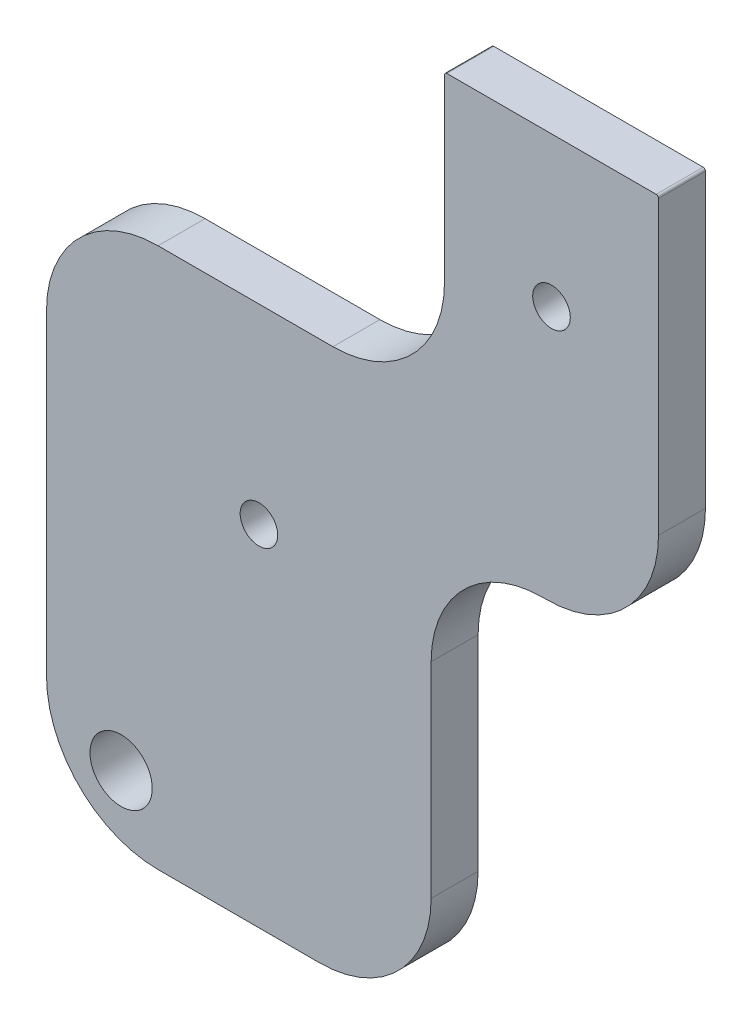
ISO-10303-21;
HEADER;
FILE_DESCRIPTION(('STEP AP214'),'2;1');
FILE_NAME('part.step','',(''),(''),'','','');
FILE_SCHEMA(('AUTOMOTIVE_DESIGN { 1 0 10303 214 1 1 1 1 }'));
ENDSEC;
DATA;
#1=APPLICATION_CONTEXT('core data for automotive mechanical design processes');
#2=APPLICATION_PROTOCOL_DEFINITION('international standard','automotive_design',2000,#1);
#3=PRODUCT_CONTEXT('',#1,'mechanical');
#4=PRODUCT('Part','Part','',(#3));
#5=PRODUCT_RELATED_PRODUCT_CATEGORY('part','',(#4));
#6=PRODUCT_DEFINITION_FORMATION('','',#4);
#7=PRODUCT_DEFINITION_CONTEXT('part definition',#1,'design');
#8=PRODUCT_DEFINITION('design','',#6,#7);
#9=PRODUCT_DEFINITION_SHAPE('','',#8);
#10=(LENGTH_UNIT() NAMED_UNIT(*) SI_UNIT(.MILLI.,.METRE.));
#11=(NAMED_UNIT(*) PLANE_ANGLE_UNIT() SI_UNIT($,.RADIAN.));
#12=(NAMED_UNIT(*) SI_UNIT($,.STERADIAN.) SOLID_ANGLE_UNIT());
#13=UNCERTAINTY_MEASURE_WITH_UNIT(LENGTH_MEASURE(1.E-05),#10,'distance_accuracy_value','');
#14=(GEOMETRIC_REPRESENTATION_CONTEXT(3) GLOBAL_UNCERTAINTY_ASSIGNED_CONTEXT((#13)) GLOBAL_UNIT_ASSIGNED_CONTEXT((#10,
#11,#12)) REPRESENTATION_CONTEXT('',''));
#15=CARTESIAN_POINT('',(0.,0.,0.));
#16=DIRECTION('',(0.,0.,1.));
#17=DIRECTION('',(1.,0.,0.));
#18=AXIS2_PLACEMENT_3D('',#15,#16,#17);
#19=CARTESIAN_POINT('',(73.2620390894138,-348.953453606646,-4.));
#20=DIRECTION('',(-1.,0.,0.));
#21=DIRECTION('',(0.,0.,1.));
#22=AXIS2_PLACEMENT_3D('',#19,#20,#21);
#23=PLANE('',#22);
#24=DIRECTION('',(0.,-1.,0.));
#25=VECTOR('',#24,1.);
#26=CARTESIAN_POINT('',(73.2620390894138,-348.953453606646,-4.));
#27=LINE('',#26,#25);
#28=CARTESIAN_POINT('',(73.2620390894138,-312.453453606646,-4.));
#29=VERTEX_POINT('',#28);
#30=CARTESIAN_POINT('',(73.2620390894138,-339.453453606646,-4.));
#31=VERTEX_POINT('',#30);
#32=EDGE_CURVE('E281',#29,#31,#27,.T.);
#33=ORIENTED_EDGE('',*,*,#32,.T.);
#34=DIRECTION('',(0.,0.,1.));
#35=VECTOR('',#34,1.);
#36=CARTESIAN_POINT('',(73.2620390894138,-339.453453606646,-4.));
#37=LINE('',#36,#35);
#38=CARTESIAN_POINT('',(73.2620390894138,-339.453453606646,0.));
#39=VERTEX_POINT('',#38);
#40=EDGE_CURVE('E182',#31,#39,#37,.T.);
#41=ORIENTED_EDGE('',*,*,#40,.T.);
#42=DIRECTION('',(0.,-1.,0.));
#43=VECTOR('',#42,1.);
#44=CARTESIAN_POINT('',(73.2620390894138,-348.953453606646,0.));
#45=LINE('',#44,#43);
#46=CARTESIAN_POINT('',(73.2620390894138,-312.453453606646,0.));
#47=VERTEX_POINT('',#46);
#48=EDGE_CURVE('E267',#47,#39,#45,.T.);
#49=ORIENTED_EDGE('',*,*,#48,.F.);
#50=DIRECTION('',(0.,0.,1.));
#51=VECTOR('',#50,1.);
#52=CARTESIAN_POINT('',(73.2620390894138,-312.453453606646,-4.));
#53=LINE('',#52,#51);
#54=EDGE_CURVE('E180',#47,#29,#53,.F.);
#55=ORIENTED_EDGE('',*,*,#54,.T.);
#56=EDGE_LOOP('',(#33,#41,#49,#55));
#57=FACE_BOUND('',#56,.T.);
#58=ADVANCED_FACE('F33',(#57),#23,.T.);
#59=CARTESIAN_POINT('',(73.2620390894138,-302.953453606646,-4.));
#60=DIRECTION('',(0.,1.,0.));
#61=DIRECTION('',(0.,0.,1.));
#62=AXIS2_PLACEMENT_3D('',#59,#60,#61);
#63=PLANE('',#62);
#64=DIRECTION('',(-1.,0.,0.));
#65=VECTOR('',#64,1.);
#66=CARTESIAN_POINT('',(73.2620390894138,-302.953453606646,0.));
#67=LINE('',#66,#65);
#68=CARTESIAN_POINT('',(97.6484216423914,-302.953453606646,0.));
#69=VERTEX_POINT('',#68);
#70=CARTESIAN_POINT('',(82.7620390894138,-302.953453606646,0.));
#71=VERTEX_POINT('',#70);
#72=EDGE_CURVE('E154',#69,#71,#67,.T.);
#73=ORIENTED_EDGE('',*,*,#72,.F.);
#74=DIRECTION('',(0.,0.,1.));
#75=VECTOR('',#74,1.);
#76=CARTESIAN_POINT('',(97.6484216423914,-302.953453606646,-4.));
#77=LINE('',#76,#75);
#78=CARTESIAN_POINT('',(97.6484216423914,-302.953453606646,-4.));
#79=VERTEX_POINT('',#78);
#80=EDGE_CURVE('E163',#69,#79,#77,.F.);
#81=ORIENTED_EDGE('',*,*,#80,.T.);
#82=DIRECTION('',(-1.,0.,0.));
#83=VECTOR('',#82,1.);
#84=CARTESIAN_POINT('',(73.2620390894138,-302.953453606646,-4.));
#85=LINE('',#84,#83);
#86=CARTESIAN_POINT('',(82.7620390894138,-302.953453606646,-4.));
#87=VERTEX_POINT('',#86);
#88=EDGE_CURVE('E171',#79,#87,#85,.T.);
#89=ORIENTED_EDGE('',*,*,#88,.T.);
#90=DIRECTION('',(0.,0.,1.));
#91=VECTOR('',#90,1.);
#92=CARTESIAN_POINT('',(82.7620390894138,-302.953453606646,-4.));
#93=LINE('',#92,#91);
#94=EDGE_CURVE('E170',#87,#71,#93,.T.);
#95=ORIENTED_EDGE('',*,*,#94,.T.);
#96=EDGE_LOOP('',(#73,#81,#89,#95));
#97=FACE_BOUND('',#96,.T.);
#98=ADVANCED_FACE('F329',(#97),#63,.T.);
#99=CARTESIAN_POINT('',(107.148421642391,-277.953453606646,-4.));
#100=DIRECTION('',(-1.,0.,0.));
#101=DIRECTION('',(0.,0.,1.));
#102=AXIS2_PLACEMENT_3D('',#99,#100,#101);
#103=PLANE('',#102);
#104=DIRECTION('',(0.,-1.,0.));
#105=VECTOR('',#104,1.);
#106=CARTESIAN_POINT('',(107.148421642391,-277.953453606646,0.));
#107=LINE('',#106,#105);
#108=CARTESIAN_POINT('',(107.148421642391,-278.153453606646,0.));
#109=VERTEX_POINT('',#108);
#110=CARTESIAN_POINT('',(107.148421642391,-293.453453606646,0.));
#111=VERTEX_POINT('',#110);
#112=EDGE_CURVE('E144',#109,#111,#107,.T.);
#113=ORIENTED_EDGE('',*,*,#112,.F.);
#114=DIRECTION('',(0.,0.,1.));
#115=VECTOR('',#114,1.);
#116=CARTESIAN_POINT('',(107.148421642391,-278.153453606646,-4.));
#117=LINE('',#116,#115);
#118=CARTESIAN_POINT('',(107.148421642391,-278.153453606646,-4.));
#119=VERTEX_POINT('',#118);
#120=EDGE_CURVE('E11',#109,#119,#117,.F.);
#121=ORIENTED_EDGE('',*,*,#120,.T.);
#122=DIRECTION('',(0.,-1.,0.));
#123=VECTOR('',#122,1.);
#124=CARTESIAN_POINT('',(107.148421642391,-277.953453606646,-4.));
#125=LINE('',#124,#123);
#126=CARTESIAN_POINT('',(107.148421642391,-293.453453606646,-4.));
#127=VERTEX_POINT('',#126);
#128=EDGE_CURVE('E168',#119,#127,#125,.T.);
#129=ORIENTED_EDGE('',*,*,#128,.T.);
#130=DIRECTION('',(0.,0.,1.));
#131=VECTOR('',#130,1.);
#132=CARTESIAN_POINT('',(107.148421642391,-293.453453606646,0.));
#133=LINE('',#132,#131);
#134=EDGE_CURVE('E162',#127,#111,#133,.T.);
#135=ORIENTED_EDGE('',*,*,#134,.T.);
#136=EDGE_LOOP('',(#113,#121,#129,#135));
#137=FACE_BOUND('',#136,.T.);
#138=ADVANCED_FACE('F167',(#137),#103,.T.);
#139=CARTESIAN_POINT('',(107.148421642391,-277.953453606646,-4.));
#140=DIRECTION('',(0.,1.,0.));
#141=DIRECTION('',(0.,0.,1.));
#142=AXIS2_PLACEMENT_3D('',#139,#140,#141);
#143=PLANE('',#142);
#144=DIRECTION('',(-1.,0.,0.));
#145=VECTOR('',#144,1.);
#146=CARTESIAN_POINT('',(107.148421642391,-277.953453606646,0.));
#147=LINE('',#146,#145);
#148=CARTESIAN_POINT('',(125.168421642391,-277.953453606646,0.));
#149=VERTEX_POINT('',#148);
#150=CARTESIAN_POINT('',(107.348421642391,-277.953453606646,0.));
#151=VERTEX_POINT('',#150);
#152=EDGE_CURVE('E155',#149,#151,#147,.T.);
#153=ORIENTED_EDGE('',*,*,#152,.F.);
#154=DIRECTION('',(0.,0.,1.));
#155=VECTOR('',#154,1.);
#156=CARTESIAN_POINT('',(125.168421642391,-277.953453606646,-4.));
#157=LINE('',#156,#155);
#158=CARTESIAN_POINT('',(125.168421642391,-277.953453606646,-4.));
#159=VERTEX_POINT('',#158);
#160=EDGE_CURVE('E231',#149,#159,#157,.F.);
#161=ORIENTED_EDGE('',*,*,#160,.T.);
#162=DIRECTION('',(-1.,0.,0.));
#163=VECTOR('',#162,1.);
#164=CARTESIAN_POINT('',(107.148421642391,-277.953453606646,-4.));
#165=LINE('',#164,#163);
#166=CARTESIAN_POINT('',(107.348421642391,-277.953453606646,-4.));
#167=VERTEX_POINT('',#166);
#168=EDGE_CURVE('E239',#159,#167,#165,.T.);
#169=ORIENTED_EDGE('',*,*,#168,.T.);
#170=DIRECTION('',(0.,0.,1.));
#171=VECTOR('',#170,1.);
#172=CARTESIAN_POINT('',(107.348421642391,-277.953453606646,-4.));
#173=LINE('',#172,#171);
#174=EDGE_CURVE('E228',#167,#151,#173,.T.);
#175=ORIENTED_EDGE('',*,*,#174,.T.);
#176=EDGE_LOOP('',(#153,#161,#169,#175));
#177=FACE_BOUND('',#176,.T.);
#178=ADVANCED_FACE('F253',(#177),#143,.T.);
#179=CARTESIAN_POINT('',(125.368421642391,-312.503453606646,-4.));
#180=DIRECTION('',(1.,0.,0.));
#181=DIRECTION('',(0.,0.,-1.));
#182=AXIS2_PLACEMENT_3D('',#179,#180,#181);
#183=PLANE('',#182);
#184=DIRECTION('',(0.,1.,0.));
#185=VECTOR('',#184,1.);
#186=CARTESIAN_POINT('',(125.368421642391,-312.503453606646,-4.));
#187=LINE('',#186,#185);
#188=CARTESIAN_POINT('',(125.368421642391,-303.003453606646,-4.));
#189=VERTEX_POINT('',#188);
#190=CARTESIAN_POINT('',(125.368421642391,-278.153453606646,-4.));
#191=VERTEX_POINT('',#190);
#192=EDGE_CURVE('E237',#189,#191,#187,.T.);
#193=ORIENTED_EDGE('',*,*,#192,.T.);
#194=DIRECTION('',(0.,0.,1.));
#195=VECTOR('',#194,1.);
#196=CARTESIAN_POINT('',(125.368421642391,-278.153453606646,-4.));
#197=LINE('',#196,#195);
#198=CARTESIAN_POINT('',(125.368421642391,-278.153453606646,0.));
#199=VERTEX_POINT('',#198);
#200=EDGE_CURVE('E222',#191,#199,#197,.T.);
#201=ORIENTED_EDGE('',*,*,#200,.T.);
#202=DIRECTION('',(0.,1.,0.));
#203=VECTOR('',#202,1.);
#204=CARTESIAN_POINT('',(125.368421642391,-312.503453606646,0.));
#205=LINE('',#204,#203);
#206=CARTESIAN_POINT('',(125.368421642391,-303.003453606646,0.));
#207=VERTEX_POINT('',#206);
#208=EDGE_CURVE('E251',#207,#199,#205,.T.);
#209=ORIENTED_EDGE('',*,*,#208,.F.);
#210=DIRECTION('',(0.,0.,1.));
#211=VECTOR('',#210,1.);
#212=CARTESIAN_POINT('',(125.368421642391,-303.003453606646,-4.));
#213=LINE('',#212,#211);
#214=EDGE_CURVE('E165',#207,#189,#213,.F.);
#215=ORIENTED_EDGE('',*,*,#214,.T.);
#216=EDGE_LOOP('',(#193,#201,#209,#215));
#217=FACE_BOUND('',#216,.T.);
#218=ADVANCED_FACE('F244',(#217),#183,.T.);
#219=CARTESIAN_POINT('',(125.368421642391,-312.503453606646,-4.));
#220=DIRECTION('',(0.,-1.,0.));
#221=DIRECTION('',(0.,0.,-1.));
#222=AXIS2_PLACEMENT_3D('',#219,#220,#221);
#223=PLANE('',#222);
#224=DIRECTION('',(1.,0.,0.));
#225=VECTOR('',#224,1.);
#226=CARTESIAN_POINT('',(125.368421642391,-312.503453606646,0.));
#227=LINE('',#226,#225);
#228=CARTESIAN_POINT('',(115.508421642391,-312.503453606646,0.));
#229=VERTEX_POINT('',#228);
#230=CARTESIAN_POINT('',(115.868421642391,-312.503453606646,0.));
#231=VERTEX_POINT('',#230);
#232=EDGE_CURVE('E256',#229,#231,#227,.T.);
#233=ORIENTED_EDGE('',*,*,#232,.F.);
#234=DIRECTION('',(0.,0.,1.));
#235=VECTOR('',#234,1.);
#236=CARTESIAN_POINT('',(115.508421642391,-312.503453606646,-4.));
#237=LINE('',#236,#235);
#238=CARTESIAN_POINT('',(115.508421642391,-312.503453606646,-4.));
#239=VERTEX_POINT('',#238);
#240=EDGE_CURVE('E214',#229,#239,#237,.F.);
#241=ORIENTED_EDGE('',*,*,#240,.T.);
#242=DIRECTION('',(1.,0.,0.));
#243=VECTOR('',#242,1.);
#244=CARTESIAN_POINT('',(125.368421642391,-312.503453606646,-4.));
#245=LINE('',#244,#243);
#246=CARTESIAN_POINT('',(115.868421642391,-312.503453606646,-4.));
#247=VERTEX_POINT('',#246);
#248=EDGE_CURVE('E247',#239,#247,#245,.T.);
#249=ORIENTED_EDGE('',*,*,#248,.T.);
#250=DIRECTION('',(0.,0.,1.));
#251=VECTOR('',#250,1.);
#252=CARTESIAN_POINT('',(115.868421642391,-312.503453606646,-4.));
#253=LINE('',#252,#251);
#254=EDGE_CURVE('E211',#247,#231,#253,.T.);
#255=ORIENTED_EDGE('',*,*,#254,.T.);
#256=EDGE_LOOP('',(#233,#241,#249,#255));
#257=FACE_BOUND('',#256,.T.);
#258=ADVANCED_FACE('F386',(#257),#223,.T.);
#259=CARTESIAN_POINT('',(106.008421642391,-348.953453606646,-4.));
#260=DIRECTION('',(1.,0.,0.));
#261=DIRECTION('',(0.,0.,-1.));
#262=AXIS2_PLACEMENT_3D('',#259,#260,#261);
#263=PLANE('',#262);
#264=DIRECTION('',(0.,1.,0.));
#265=VECTOR('',#264,1.);
#266=CARTESIAN_POINT('',(106.008421642391,-348.953453606646,-4.));
#267=LINE('',#266,#265);
#268=CARTESIAN_POINT('',(106.008421642391,-339.453453606646,-4.));
#269=VERTEX_POINT('',#268);
#270=CARTESIAN_POINT('',(106.008421642391,-322.003453606646,-4.));
#271=VERTEX_POINT('',#270);
#272=EDGE_CURVE('E275',#269,#271,#267,.T.);
#273=ORIENTED_EDGE('',*,*,#272,.T.);
#274=DIRECTION('',(0.,0.,1.));
#275=VECTOR('',#274,1.);
#276=CARTESIAN_POINT('',(106.008421642391,-322.003453606646,0.));
#277=LINE('',#276,#275);
#278=CARTESIAN_POINT('',(106.008421642391,-322.003453606646,0.));
#279=VERTEX_POINT('',#278);
#280=EDGE_CURVE('E208',#271,#279,#277,.T.);
#281=ORIENTED_EDGE('',*,*,#280,.T.);
#282=DIRECTION('',(0.,1.,0.));
#283=VECTOR('',#282,1.);
#284=CARTESIAN_POINT('',(106.008421642391,-348.953453606646,0.));
#285=LINE('',#284,#283);
#286=CARTESIAN_POINT('',(106.008421642391,-339.453453606646,0.));
#287=VERTEX_POINT('',#286);
#288=EDGE_CURVE('E261',#287,#279,#285,.T.);
#289=ORIENTED_EDGE('',*,*,#288,.F.);
#290=DIRECTION('',(0.,0.,1.));
#291=VECTOR('',#290,1.);
#292=CARTESIAN_POINT('',(106.008421642391,-339.453453606646,-4.));
#293=LINE('',#292,#291);
#294=EDGE_CURVE('E206',#287,#269,#293,.F.);
#295=ORIENTED_EDGE('',*,*,#294,.T.);
#296=EDGE_LOOP('',(#273,#281,#289,#295));
#297=FACE_BOUND('',#296,.T.);
#298=ADVANCED_FACE('F377',(#297),#263,.T.);
#299=CARTESIAN_POINT('',(73.2620390894138,-348.953453606646,-4.));
#300=DIRECTION('',(0.,-1.,0.));
#301=DIRECTION('',(0.,0.,-1.));
#302=AXIS2_PLACEMENT_3D('',#299,#300,#301);
#303=PLANE('',#302);
#304=DIRECTION('',(1.,0.,0.));
#305=VECTOR('',#304,1.);
#306=CARTESIAN_POINT('',(73.2620390894138,-348.953453606646,0.));
#307=LINE('',#306,#305);
#308=CARTESIAN_POINT('',(82.7620390894138,-348.953453606646,0.));
#309=VERTEX_POINT('',#308);
#310=CARTESIAN_POINT('',(96.5084216423913,-348.953453606646,0.));
#311=VERTEX_POINT('',#310);
#312=EDGE_CURVE('E264',#309,#311,#307,.T.);
#313=ORIENTED_EDGE('',*,*,#312,.F.);
#314=DIRECTION('',(0.,0.,1.));
#315=VECTOR('',#314,1.);
#316=CARTESIAN_POINT('',(82.7620390894138,-348.953453606646,-4.));
#317=LINE('',#316,#315);
#318=CARTESIAN_POINT('',(82.7620390894138,-348.953453606646,-4.));
#319=VERTEX_POINT('',#318);
#320=EDGE_CURVE('E196',#309,#319,#317,.F.);
#321=ORIENTED_EDGE('',*,*,#320,.T.);
#322=DIRECTION('',(1.,0.,0.));
#323=VECTOR('',#322,1.);
#324=CARTESIAN_POINT('',(73.2620390894138,-348.953453606646,-4.));
#325=LINE('',#324,#323);
#326=CARTESIAN_POINT('',(96.5084216423913,-348.953453606646,-4.));
#327=VERTEX_POINT('',#326);
#328=EDGE_CURVE('E278',#319,#327,#325,.T.);
#329=ORIENTED_EDGE('',*,*,#328,.T.);
#330=DIRECTION('',(0.,0.,1.));
#331=VECTOR('',#330,1.);
#332=CARTESIAN_POINT('',(96.5084216423913,-348.953453606646,-4.));
#333=LINE('',#332,#331);
#334=EDGE_CURVE('E193',#327,#311,#333,.T.);
#335=ORIENTED_EDGE('',*,*,#334,.T.);
#336=EDGE_LOOP('',(#313,#321,#329,#335));
#337=FACE_BOUND('',#336,.T.);
#338=ADVANCED_FACE('F339',(#337),#303,.T.);
#339=CARTESIAN_POINT('',(0.,0.,-4.));
#340=DIRECTION('',(0.,0.,-1.));
#341=DIRECTION('',(-1.,0.,0.));
#342=AXIS2_PLACEMENT_3D('',#339,#340,#341);
#343=PLANE('',#342);
#344=CARTESIAN_POINT('',(79.6121425415507,-343.223274497217,-4.));
#345=DIRECTION('',(0.,0.,1.));
#346=DIRECTION('',(1.,0.,0.));
#347=AXIS2_PLACEMENT_3D('',#344,#345,#346);
#348=CIRCLE('',#347,2.65);
#349=CARTESIAN_POINT('',(82.2621425415507,-343.223274497217,-4.));
#350=VERTEX_POINT('',#349);
#351=EDGE_CURVE('E295',#350,#350,#348,.T.);
#352=ORIENTED_EDGE('',*,*,#351,.T.);
#353=EDGE_LOOP('',(#352));
#354=FACE_BOUND('',#353,.T.);
#355=CARTESIAN_POINT('',(116.258421642391,-290.703453606646,-4.));
#356=DIRECTION('',(0.,0.,1.));
#357=DIRECTION('',(1.,0.,0.));
#358=AXIS2_PLACEMENT_3D('',#355,#356,#357);
#359=CIRCLE('',#358,1.59999999999999);
#360=CARTESIAN_POINT('',(117.858421642391,-290.703453606646,-4.));
#361=VERTEX_POINT('',#360);
#362=EDGE_CURVE('E289',#361,#361,#359,.T.);
#363=ORIENTED_EDGE('',*,*,#362,.T.);
#364=EDGE_LOOP('',(#363));
#365=FACE_BOUND('',#364,.T.);
#366=CARTESIAN_POINT('',(91.3484216423913,-319.203453606646,-4.));
#367=DIRECTION('',(0.,0.,1.));
#368=DIRECTION('',(1.,0.,0.));
#369=AXIS2_PLACEMENT_3D('',#366,#367,#368);
#370=CIRCLE('',#369,1.59999999999999);
#371=CARTESIAN_POINT('',(92.9484216423913,-319.203453606646,-4.));
#372=VERTEX_POINT('',#371);
#373=EDGE_CURVE('E269',#372,#372,#370,.T.);
#374=ORIENTED_EDGE('',*,*,#373,.T.);
#375=EDGE_LOOP('',(#374));
#376=FACE_BOUND('',#375,.T.);
#377=ORIENTED_EDGE('',*,*,#168,.F.);
#378=CARTESIAN_POINT('',(125.168421642391,-278.153453606646,-4.));
#379=DIRECTION('',(0.,0.,-1.));
#380=DIRECTION('',(-1.,0.,0.));
#381=AXIS2_PLACEMENT_3D('',#378,#379,#380);
#382=CIRCLE('',#381,0.2);
#383=EDGE_CURVE('E41',#159,#191,#382,.T.);
#384=ORIENTED_EDGE('',*,*,#383,.T.);
#385=ORIENTED_EDGE('',*,*,#192,.F.);
#386=CARTESIAN_POINT('',(115.868421642391,-303.003453606646,-4.));
#387=DIRECTION('',(0.,0.,-1.));
#388=DIRECTION('',(-1.,0.,0.));
#389=AXIS2_PLACEMENT_3D('',#386,#387,#388);
#390=CIRCLE('',#389,9.5);
#391=EDGE_CURVE('E202',#189,#247,#390,.T.);
#392=ORIENTED_EDGE('',*,*,#391,.T.);
#393=ORIENTED_EDGE('',*,*,#248,.F.);
#394=CARTESIAN_POINT('',(115.508421642391,-322.003453606646,-4.));
#395=DIRECTION('',(0.,0.,-1.));
#396=DIRECTION('',(-1.,0.,0.));
#397=AXIS2_PLACEMENT_3D('',#394,#395,#396);
#398=CIRCLE('',#397,9.5);
#399=EDGE_CURVE('E220',#239,#271,#398,.F.);
#400=ORIENTED_EDGE('',*,*,#399,.T.);
#401=ORIENTED_EDGE('',*,*,#272,.F.);
#402=CARTESIAN_POINT('',(96.5084216423913,-339.453453606646,-4.));
#403=DIRECTION('',(0.,0.,-1.));
#404=DIRECTION('',(-1.,0.,0.));
#405=AXIS2_PLACEMENT_3D('',#402,#403,#404);
#406=CIRCLE('',#405,9.5);
#407=EDGE_CURVE('E200',#269,#327,#406,.T.);
#408=ORIENTED_EDGE('',*,*,#407,.T.);
#409=ORIENTED_EDGE('',*,*,#328,.F.);
#410=CARTESIAN_POINT('',(82.7620390894138,-339.453453606646,-4.));
#411=DIRECTION('',(0.,0.,-1.));
#412=DIRECTION('',(-1.,0.,0.));
#413=AXIS2_PLACEMENT_3D('',#410,#411,#412);
#414=CIRCLE('',#413,9.5);
#415=EDGE_CURVE('E204',#319,#31,#414,.T.);
#416=ORIENTED_EDGE('',*,*,#415,.T.);
#417=ORIENTED_EDGE('',*,*,#32,.F.);
#418=CARTESIAN_POINT('',(82.7620390894138,-312.453453606646,-4.));
#419=DIRECTION('',(0.,0.,-1.));
#420=DIRECTION('',(-1.,0.,0.));
#421=AXIS2_PLACEMENT_3D('',#418,#419,#420);
#422=CIRCLE('',#421,9.5);
#423=EDGE_CURVE('E198',#29,#87,#422,.T.);
#424=ORIENTED_EDGE('',*,*,#423,.T.);
#425=ORIENTED_EDGE('',*,*,#88,.F.);
#426=CARTESIAN_POINT('',(97.6484216423914,-293.453453606646,-4.));
#427=DIRECTION('',(0.,0.,-1.));
#428=DIRECTION('',(-1.,0.,0.));
#429=AXIS2_PLACEMENT_3D('',#426,#427,#428);
#430=CIRCLE('',#429,9.5);
#431=EDGE_CURVE('E164',#79,#127,#430,.F.);
#432=ORIENTED_EDGE('',*,*,#431,.T.);
#433=ORIENTED_EDGE('',*,*,#128,.F.);
#434=CARTESIAN_POINT('',(107.348421642391,-278.153453606646,-4.));
#435=DIRECTION('',(0.,0.,-1.));
#436=DIRECTION('',(-1.,0.,0.));
#437=AXIS2_PLACEMENT_3D('',#434,#435,#436);
#438=CIRCLE('',#437,0.2);
#439=EDGE_CURVE('E53',#119,#167,#438,.T.);
#440=ORIENTED_EDGE('',*,*,#439,.T.);
#441=EDGE_LOOP('',(#377,#384,#385,#392,#393,#400,#401,#408,#409,#416,#417,#424,#425,#432,#433,#440));
#442=FACE_BOUND('',#441,.T.);
#443=ADVANCED_FACE('F236',(#354,#365,#376,#442),#343,.T.);
#444=CARTESIAN_POINT('',(0.,0.,0.));
#445=DIRECTION('',(0.,0.,-1.));
#446=DIRECTION('',(-1.,0.,0.));
#447=AXIS2_PLACEMENT_3D('',#444,#445,#446);
#448=PLANE('',#447);
#449=CARTESIAN_POINT('',(79.6121425415507,-343.223274497217,0.));
#450=DIRECTION('',(0.,0.,1.));
#451=DIRECTION('',(1.,0.,0.));
#452=AXIS2_PLACEMENT_3D('',#449,#450,#451);
#453=CIRCLE('',#452,2.65);
#454=CARTESIAN_POINT('',(82.2621425415507,-343.223274497217,0.));
#455=VERTEX_POINT('',#454);
#456=EDGE_CURVE('E298',#455,#455,#453,.T.);
#457=ORIENTED_EDGE('',*,*,#456,.F.);
#458=EDGE_LOOP('',(#457));
#459=FACE_BOUND('',#458,.T.);
#460=CARTESIAN_POINT('',(116.258421642391,-290.703453606646,0.));
#461=DIRECTION('',(0.,0.,1.));
#462=DIRECTION('',(1.,0.,0.));
#463=AXIS2_PLACEMENT_3D('',#460,#461,#462);
#464=CIRCLE('',#463,1.59999999999999);
#465=CARTESIAN_POINT('',(117.858421642391,-290.703453606646,0.));
#466=VERTEX_POINT('',#465);
#467=EDGE_CURVE('E292',#466,#466,#464,.T.);
#468=ORIENTED_EDGE('',*,*,#467,.F.);
#469=EDGE_LOOP('',(#468));
#470=FACE_BOUND('',#469,.T.);
#471=CARTESIAN_POINT('',(91.3484216423913,-319.203453606646,0.));
#472=DIRECTION('',(0.,0.,1.));
#473=DIRECTION('',(1.,0.,0.));
#474=AXIS2_PLACEMENT_3D('',#471,#472,#473);
#475=CIRCLE('',#474,1.59999999999999);
#476=CARTESIAN_POINT('',(92.9484216423913,-319.203453606646,0.));
#477=VERTEX_POINT('',#476);
#478=EDGE_CURVE('E286',#477,#477,#475,.T.);
#479=ORIENTED_EDGE('',*,*,#478,.F.);
#480=EDGE_LOOP('',(#479));
#481=FACE_BOUND('',#480,.T.);
#482=ORIENTED_EDGE('',*,*,#208,.T.);
#483=CARTESIAN_POINT('',(125.168421642391,-278.153453606646,0.));
#484=DIRECTION('',(0.,0.,-1.));
#485=DIRECTION('',(-1.,0.,0.));
#486=AXIS2_PLACEMENT_3D('',#483,#484,#485);
#487=CIRCLE('',#486,0.2);
#488=EDGE_CURVE('E226',#199,#149,#487,.F.);
#489=ORIENTED_EDGE('',*,*,#488,.T.);
#490=ORIENTED_EDGE('',*,*,#152,.T.);
#491=CARTESIAN_POINT('',(107.348421642391,-278.153453606646,0.));
#492=DIRECTION('',(0.,0.,-1.));
#493=DIRECTION('',(-1.,0.,0.));
#494=AXIS2_PLACEMENT_3D('',#491,#492,#493);
#495=CIRCLE('',#494,0.2);
#496=EDGE_CURVE('E152',#151,#109,#495,.F.);
#497=ORIENTED_EDGE('',*,*,#496,.T.);
#498=ORIENTED_EDGE('',*,*,#112,.T.);
#499=CARTESIAN_POINT('',(97.6484216423914,-293.453453606646,0.));
#500=DIRECTION('',(0.,0.,-1.));
#501=DIRECTION('',(-1.,0.,0.));
#502=AXIS2_PLACEMENT_3D('',#499,#500,#501);
#503=CIRCLE('',#502,9.5);
#504=EDGE_CURVE('E149',#111,#69,#503,.T.);
#505=ORIENTED_EDGE('',*,*,#504,.T.);
#506=ORIENTED_EDGE('',*,*,#72,.T.);
#507=CARTESIAN_POINT('',(82.7620390894138,-312.453453606646,0.));
#508=DIRECTION('',(0.,0.,-1.));
#509=DIRECTION('',(-1.,0.,0.));
#510=AXIS2_PLACEMENT_3D('',#507,#508,#509);
#511=CIRCLE('',#510,9.5);
#512=EDGE_CURVE('E185',#71,#47,#511,.F.);
#513=ORIENTED_EDGE('',*,*,#512,.T.);
#514=ORIENTED_EDGE('',*,*,#48,.T.);
#515=CARTESIAN_POINT('',(82.7620390894138,-339.453453606646,0.));
#516=DIRECTION('',(0.,0.,-1.));
#517=DIRECTION('',(-1.,0.,0.));
#518=AXIS2_PLACEMENT_3D('',#515,#516,#517);
#519=CIRCLE('',#518,9.5);
#520=EDGE_CURVE('E191',#39,#309,#519,.F.);
#521=ORIENTED_EDGE('',*,*,#520,.T.);
#522=ORIENTED_EDGE('',*,*,#312,.T.);
#523=CARTESIAN_POINT('',(96.5084216423913,-339.453453606646,0.));
#524=DIRECTION('',(0.,0.,-1.));
#525=DIRECTION('',(-1.,0.,0.));
#526=AXIS2_PLACEMENT_3D('',#523,#524,#525);
#527=CIRCLE('',#526,9.5);
#528=EDGE_CURVE('E187',#311,#287,#527,.F.);
#529=ORIENTED_EDGE('',*,*,#528,.T.);
#530=ORIENTED_EDGE('',*,*,#288,.T.);
#531=CARTESIAN_POINT('',(115.508421642391,-322.003453606646,0.));
#532=DIRECTION('',(0.,0.,-1.));
#533=DIRECTION('',(-1.,0.,0.));
#534=AXIS2_PLACEMENT_3D('',#531,#532,#533);
#535=CIRCLE('',#534,9.5);
#536=EDGE_CURVE('E218',#279,#229,#535,.T.);
#537=ORIENTED_EDGE('',*,*,#536,.T.);
#538=ORIENTED_EDGE('',*,*,#232,.T.);
#539=CARTESIAN_POINT('',(115.868421642391,-303.003453606646,0.));
#540=DIRECTION('',(0.,0.,-1.));
#541=DIRECTION('',(-1.,0.,0.));
#542=AXIS2_PLACEMENT_3D('',#539,#540,#541);
#543=CIRCLE('',#542,9.5);
#544=EDGE_CURVE('E189',#231,#207,#543,.F.);
#545=ORIENTED_EDGE('',*,*,#544,.T.);
#546=EDGE_LOOP('',(#482,#489,#490,#497,#498,#505,#506,#513,#514,#521,#522,#529,#530,#537,#538,#545));
#547=FACE_BOUND('',#546,.T.);
#548=ADVANCED_FACE('F147',(#459,#470,#481,#547),#448,.F.);
#549=CARTESIAN_POINT('',(97.6484216423914,-293.453453606646,-4.));
#550=DIRECTION('',(0.,0.,-1.));
#551=DIRECTION('',(-1.,0.,0.));
#552=AXIS2_PLACEMENT_3D('',#549,#550,#551);
#553=CYLINDRICAL_SURFACE('',#552,9.5);
#554=ORIENTED_EDGE('',*,*,#431,.F.);
#555=ORIENTED_EDGE('',*,*,#80,.F.);
#556=ORIENTED_EDGE('',*,*,#504,.F.);
#557=ORIENTED_EDGE('',*,*,#134,.F.);
#558=EDGE_LOOP('',(#554,#555,#556,#557));
#559=FACE_BOUND('',#558,.T.);
#560=ADVANCED_FACE('F161',(#559),#553,.F.);
#561=CARTESIAN_POINT('',(82.7620390894138,-339.453453606646,-4.));
#562=DIRECTION('',(0.,0.,1.));
#563=DIRECTION('',(1.,0.,0.));
#564=AXIS2_PLACEMENT_3D('',#561,#562,#563);
#565=CYLINDRICAL_SURFACE('',#564,9.5);
#566=ORIENTED_EDGE('',*,*,#415,.F.);
#567=ORIENTED_EDGE('',*,*,#320,.F.);
#568=ORIENTED_EDGE('',*,*,#520,.F.);
#569=ORIENTED_EDGE('',*,*,#40,.F.);
#570=EDGE_LOOP('',(#566,#567,#568,#569));
#571=FACE_BOUND('',#570,.T.);
#572=ADVANCED_FACE('F343',(#571),#565,.T.);
#573=CARTESIAN_POINT('',(115.508421642391,-322.003453606646,-4.));
#574=DIRECTION('',(0.,0.,-1.));
#575=DIRECTION('',(-1.,0.,0.));
#576=AXIS2_PLACEMENT_3D('',#573,#574,#575);
#577=CYLINDRICAL_SURFACE('',#576,9.5);
#578=ORIENTED_EDGE('',*,*,#399,.F.);
#579=ORIENTED_EDGE('',*,*,#240,.F.);
#580=ORIENTED_EDGE('',*,*,#536,.F.);
#581=ORIENTED_EDGE('',*,*,#280,.F.);
#582=EDGE_LOOP('',(#578,#579,#580,#581));
#583=FACE_BOUND('',#582,.T.);
#584=ADVANCED_FACE('F346',(#583),#577,.F.);
#585=CARTESIAN_POINT('',(115.868421642391,-303.003453606646,-4.));
#586=DIRECTION('',(0.,0.,1.));
#587=DIRECTION('',(1.,0.,0.));
#588=AXIS2_PLACEMENT_3D('',#585,#586,#587);
#589=CYLINDRICAL_SURFACE('',#588,9.5);
#590=ORIENTED_EDGE('',*,*,#391,.F.);
#591=ORIENTED_EDGE('',*,*,#214,.F.);
#592=ORIENTED_EDGE('',*,*,#544,.F.);
#593=ORIENTED_EDGE('',*,*,#254,.F.);
#594=EDGE_LOOP('',(#590,#591,#592,#593));
#595=FACE_BOUND('',#594,.T.);
#596=ADVANCED_FACE('F350',(#595),#589,.T.);
#597=CARTESIAN_POINT('',(96.5084216423913,-339.453453606646,-4.));
#598=DIRECTION('',(0.,0.,1.));
#599=DIRECTION('',(1.,0.,0.));
#600=AXIS2_PLACEMENT_3D('',#597,#598,#599);
#601=CYLINDRICAL_SURFACE('',#600,9.5);
#602=ORIENTED_EDGE('',*,*,#407,.F.);
#603=ORIENTED_EDGE('',*,*,#294,.F.);
#604=ORIENTED_EDGE('',*,*,#528,.F.);
#605=ORIENTED_EDGE('',*,*,#334,.F.);
#606=EDGE_LOOP('',(#602,#603,#604,#605));
#607=FACE_BOUND('',#606,.T.);
#608=ADVANCED_FACE('F323',(#607),#601,.T.);
#609=CARTESIAN_POINT('',(82.7620390894138,-312.453453606646,-4.));
#610=DIRECTION('',(0.,0.,1.));
#611=DIRECTION('',(1.,0.,0.));
#612=AXIS2_PLACEMENT_3D('',#609,#610,#611);
#613=CYLINDRICAL_SURFACE('',#612,9.5);
#614=ORIENTED_EDGE('',*,*,#423,.F.);
#615=ORIENTED_EDGE('',*,*,#54,.F.);
#616=ORIENTED_EDGE('',*,*,#512,.F.);
#617=ORIENTED_EDGE('',*,*,#94,.F.);
#618=EDGE_LOOP('',(#614,#615,#616,#617));
#619=FACE_BOUND('',#618,.T.);
#620=ADVANCED_FACE('F314',(#619),#613,.T.);
#621=CARTESIAN_POINT('',(91.3484216423913,-319.203453606646,0.));
#622=DIRECTION('',(0.,0.,1.));
#623=DIRECTION('',(1.,0.,0.));
#624=AXIS2_PLACEMENT_3D('',#621,#622,#623);
#625=CYLINDRICAL_SURFACE('',#624,1.59999999999999);
#626=ORIENTED_EDGE('',*,*,#373,.F.);
#627=EDGE_LOOP('',(#626));
#628=FACE_BOUND('',#627,.T.);
#629=ORIENTED_EDGE('',*,*,#478,.T.);
#630=EDGE_LOOP('',(#629));
#631=FACE_BOUND('',#630,.T.);
#632=ADVANCED_FACE('F311',(#628,#631),#625,.F.);
#633=CARTESIAN_POINT('',(116.258421642391,-290.703453606646,0.));
#634=DIRECTION('',(0.,0.,1.));
#635=DIRECTION('',(1.,0.,0.));
#636=AXIS2_PLACEMENT_3D('',#633,#634,#635);
#637=CYLINDRICAL_SURFACE('',#636,1.59999999999999);
#638=ORIENTED_EDGE('',*,*,#362,.F.);
#639=EDGE_LOOP('',(#638));
#640=FACE_BOUND('',#639,.T.);
#641=ORIENTED_EDGE('',*,*,#467,.T.);
#642=EDGE_LOOP('',(#641));
#643=FACE_BOUND('',#642,.T.);
#644=ADVANCED_FACE('F313',(#640,#643),#637,.F.);
#645=CARTESIAN_POINT('',(79.6121425415507,-343.223274497217,0.));
#646=DIRECTION('',(0.,0.,1.));
#647=DIRECTION('',(1.,0.,0.));
#648=AXIS2_PLACEMENT_3D('',#645,#646,#647);
#649=CYLINDRICAL_SURFACE('',#648,2.65);
#650=ORIENTED_EDGE('',*,*,#351,.F.);
#651=EDGE_LOOP('',(#650));
#652=FACE_BOUND('',#651,.T.);
#653=ORIENTED_EDGE('',*,*,#456,.T.);
#654=EDGE_LOOP('',(#653));
#655=FACE_BOUND('',#654,.T.);
#656=ADVANCED_FACE('F302',(#652,#655),#649,.F.);
#657=CARTESIAN_POINT('',(125.168421642391,-278.153453606646,-4.));
#658=DIRECTION('',(0.,0.,1.));
#659=DIRECTION('',(1.,0.,0.));
#660=AXIS2_PLACEMENT_3D('',#657,#658,#659);
#661=CYLINDRICAL_SURFACE('',#660,0.2);
#662=ORIENTED_EDGE('',*,*,#383,.F.);
#663=ORIENTED_EDGE('',*,*,#160,.F.);
#664=ORIENTED_EDGE('',*,*,#488,.F.);
#665=ORIENTED_EDGE('',*,*,#200,.F.);
#666=EDGE_LOOP('',(#662,#663,#664,#665));
#667=FACE_BOUND('',#666,.T.);
#668=ADVANCED_FACE('F249',(#667),#661,.T.);
#669=CARTESIAN_POINT('',(107.348421642391,-278.153453606646,-4.));
#670=DIRECTION('',(0.,0.,1.));
#671=DIRECTION('',(1.,0.,0.));
#672=AXIS2_PLACEMENT_3D('',#669,#670,#671);
#673=CYLINDRICAL_SURFACE('',#672,0.2);
#674=ORIENTED_EDGE('',*,*,#439,.F.);
#675=ORIENTED_EDGE('',*,*,#120,.F.);
#676=ORIENTED_EDGE('',*,*,#496,.F.);
#677=ORIENTED_EDGE('',*,*,#174,.F.);
#678=EDGE_LOOP('',(#674,#675,#676,#677));
#679=FACE_BOUND('',#678,.T.);
#680=ADVANCED_FACE('F35',(#679),#673,.T.);
#681=CLOSED_SHELL('',(#58,#98,#138,#178,#218,#258,#298,#338,#443,#548,#560,#572,#584,#596,#608,
#620,#632,#644,#656,#668,#680));
#682=MANIFOLD_SOLID_BREP('B2',#681);
#683=ADVANCED_BREP_SHAPE_REPRESENTATION('',(#18,#682),#14);
#684=SHAPE_DEFINITION_REPRESENTATION(#9,#683);
ENDSEC;
END-ISO-10303-21;
